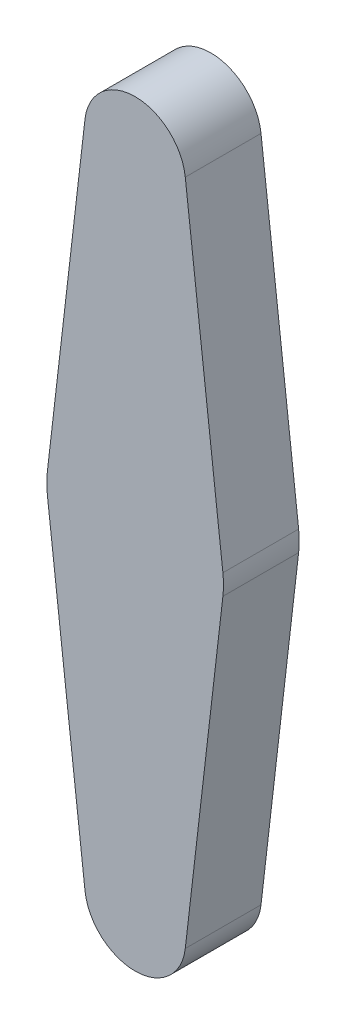
ISO-10303-21;
HEADER;
FILE_DESCRIPTION(('STEP AP214'),'2;1');
FILE_NAME('part.step','',(''),(''),'','','');
FILE_SCHEMA(('AUTOMOTIVE_DESIGN { 1 0 10303 214 1 1 1 1 }'));
ENDSEC;
DATA;
#1=APPLICATION_CONTEXT('core data for automotive mechanical design processes');
#2=APPLICATION_PROTOCOL_DEFINITION('international standard','automotive_design',2000,#1);
#3=PRODUCT_CONTEXT('',#1,'mechanical');
#4=PRODUCT('Part','Part','',(#3));
#5=PRODUCT_RELATED_PRODUCT_CATEGORY('part','',(#4));
#6=PRODUCT_DEFINITION_FORMATION('','',#4);
#7=PRODUCT_DEFINITION_CONTEXT('part definition',#1,'design');
#8=PRODUCT_DEFINITION('design','',#6,#7);
#9=PRODUCT_DEFINITION_SHAPE('','',#8);
#10=(LENGTH_UNIT() NAMED_UNIT(*) SI_UNIT(.MILLI.,.METRE.));
#11=(NAMED_UNIT(*) PLANE_ANGLE_UNIT() SI_UNIT($,.RADIAN.));
#12=(NAMED_UNIT(*) SI_UNIT($,.STERADIAN.) SOLID_ANGLE_UNIT());
#13=UNCERTAINTY_MEASURE_WITH_UNIT(LENGTH_MEASURE(1.E-05),#10,'distance_accuracy_value','');
#14=(GEOMETRIC_REPRESENTATION_CONTEXT(3) GLOBAL_UNCERTAINTY_ASSIGNED_CONTEXT((#13)) GLOBAL_UNIT_ASSIGNED_CONTEXT((#10,
#11,#12)) REPRESENTATION_CONTEXT('',''));
#15=CARTESIAN_POINT('',(0.,0.,0.));
#16=DIRECTION('',(0.,0.,1.));
#17=DIRECTION('',(1.,0.,0.));
#18=AXIS2_PLACEMENT_3D('',#15,#16,#17);
#19=CARTESIAN_POINT('',(0.,-13.,3.));
#20=DIRECTION('',(0.,0.,-1.));
#21=DIRECTION('',(-1.,0.,0.));
#22=AXIS2_PLACEMENT_3D('',#19,#20,#21);
#23=CYLINDRICAL_SURFACE('',#22,2.);
#24=CARTESIAN_POINT('',(0.,-13.,0.));
#25=DIRECTION('',(0.,0.,1.));
#26=DIRECTION('',(-1.,0.,0.));
#27=AXIS2_PLACEMENT_3D('',#24,#25,#26);
#28=CIRCLE('',#27,2.);
#29=CARTESIAN_POINT('',(-1.9866417800223,-13.2307692307692,0.));
#30=VERTEX_POINT('',#29);
#31=CARTESIAN_POINT('',(1.9866417800223,-13.2307692307692,0.));
#32=VERTEX_POINT('',#31);
#33=EDGE_CURVE('E135',#30,#32,#28,.T.);
#34=ORIENTED_EDGE('',*,*,#33,.T.);
#35=DIRECTION('',(0.,0.,-1.));
#36=VECTOR('',#35,1.);
#37=CARTESIAN_POINT('',(1.9866417800223,-13.2307692307692,3.));
#38=LINE('',#37,#36);
#39=CARTESIAN_POINT('',(1.9866417800223,-13.2307692307692,3.));
#40=VERTEX_POINT('',#39);
#41=EDGE_CURVE('E11',#40,#32,#38,.T.);
#42=ORIENTED_EDGE('',*,*,#41,.F.);
#43=CARTESIAN_POINT('',(0.,-13.,3.));
#44=DIRECTION('',(0.,0.,1.));
#45=DIRECTION('',(-1.,0.,0.));
#46=AXIS2_PLACEMENT_3D('',#43,#44,#45);
#47=CIRCLE('',#46,2.);
#48=CARTESIAN_POINT('',(-1.9866417800223,-13.2307692307692,3.));
#49=VERTEX_POINT('',#48);
#50=EDGE_CURVE('E149',#49,#40,#47,.T.);
#51=ORIENTED_EDGE('',*,*,#50,.F.);
#52=DIRECTION('',(0.,0.,-1.));
#53=VECTOR('',#52,1.);
#54=CARTESIAN_POINT('',(-1.9866417800223,-13.2307692307692,3.));
#55=LINE('',#54,#53);
#56=EDGE_CURVE('E131',#49,#30,#55,.T.);
#57=ORIENTED_EDGE('',*,*,#56,.T.);
#58=EDGE_LOOP('',(#34,#42,#51,#57));
#59=FACE_BOUND('',#58,.T.);
#60=ADVANCED_FACE('F39',(#59),#23,.T.);
#61=CARTESIAN_POINT('',(1.9866417800223,-13.2307692307692,3.));
#62=DIRECTION('',(-0.99332089001115,0.115384615384615,0.));
#63=DIRECTION('',(-0.115384615384615,-0.993320890011151,0.));
#64=AXIS2_PLACEMENT_3D('',#61,#62,#63);
#65=PLANE('',#64);
#66=DIRECTION('',(0.115384615384615,0.993320890011151,0.));
#67=VECTOR('',#66,1.);
#68=CARTESIAN_POINT('',(1.9866417800223,-13.2307692307692,0.));
#69=LINE('',#68,#67);
#70=CARTESIAN_POINT('',(3.47662311503903,-0.403846153846155,0.));
#71=VERTEX_POINT('',#70);
#72=EDGE_CURVE('E138',#32,#71,#69,.T.);
#73=ORIENTED_EDGE('',*,*,#72,.T.);
#74=DIRECTION('',(0.,0.,-1.));
#75=VECTOR('',#74,1.);
#76=CARTESIAN_POINT('',(3.47662311503903,-0.403846153846155,3.));
#77=LINE('',#76,#75);
#78=CARTESIAN_POINT('',(3.47662311503903,-0.403846153846155,3.));
#79=VERTEX_POINT('',#78);
#80=EDGE_CURVE('E47',#79,#71,#77,.T.);
#81=ORIENTED_EDGE('',*,*,#80,.F.);
#82=DIRECTION('',(0.115384615384615,0.993320890011151,0.));
#83=VECTOR('',#82,1.);
#84=CARTESIAN_POINT('',(1.9866417800223,-13.2307692307692,3.));
#85=LINE('',#84,#83);
#86=EDGE_CURVE('E98',#40,#79,#85,.T.);
#87=ORIENTED_EDGE('',*,*,#86,.F.);
#88=ORIENTED_EDGE('',*,*,#41,.T.);
#89=EDGE_LOOP('',(#73,#81,#87,#88));
#90=FACE_BOUND('',#89,.T.);
#91=ADVANCED_FACE('F184',(#90),#65,.F.);
#92=CARTESIAN_POINT('',(0.,0.,3.));
#93=DIRECTION('',(0.,0.,-1.));
#94=DIRECTION('',(-1.,0.,0.));
#95=AXIS2_PLACEMENT_3D('',#92,#93,#94);
#96=CYLINDRICAL_SURFACE('',#95,3.5);
#97=CARTESIAN_POINT('',(0.,0.,0.));
#98=DIRECTION('',(0.,0.,1.));
#99=DIRECTION('',(1.,0.,0.));
#100=AXIS2_PLACEMENT_3D('',#97,#98,#99);
#101=CIRCLE('',#100,3.5);
#102=CARTESIAN_POINT('',(3.47662311503903,0.403846153846154,0.));
#103=VERTEX_POINT('',#102);
#104=EDGE_CURVE('E140',#71,#103,#101,.T.);
#105=ORIENTED_EDGE('',*,*,#104,.T.);
#106=DIRECTION('',(0.,0.,-1.));
#107=VECTOR('',#106,1.);
#108=CARTESIAN_POINT('',(3.47662311503903,0.403846153846154,3.));
#109=LINE('',#108,#107);
#110=CARTESIAN_POINT('',(3.47662311503903,0.403846153846154,3.));
#111=VERTEX_POINT('',#110);
#112=EDGE_CURVE('E156',#111,#103,#109,.T.);
#113=ORIENTED_EDGE('',*,*,#112,.F.);
#114=CARTESIAN_POINT('',(0.,0.,3.));
#115=DIRECTION('',(0.,0.,1.));
#116=DIRECTION('',(1.,0.,0.));
#117=AXIS2_PLACEMENT_3D('',#114,#115,#116);
#118=CIRCLE('',#117,3.5);
#119=EDGE_CURVE('E164',#79,#111,#118,.T.);
#120=ORIENTED_EDGE('',*,*,#119,.F.);
#121=ORIENTED_EDGE('',*,*,#80,.T.);
#122=EDGE_LOOP('',(#105,#113,#120,#121));
#123=FACE_BOUND('',#122,.T.);
#124=ADVANCED_FACE('F162',(#123),#96,.T.);
#125=CARTESIAN_POINT('',(1.9866417800223,13.2307692307692,3.));
#126=DIRECTION('',(-0.99332089001115,-0.115384615384615,0.));
#127=DIRECTION('',(0.115384615384615,-0.993320890011151,0.));
#128=AXIS2_PLACEMENT_3D('',#125,#126,#127);
#129=PLANE('',#128);
#130=DIRECTION('',(-0.115384615384615,0.993320890011151,0.));
#131=VECTOR('',#130,1.);
#132=CARTESIAN_POINT('',(1.9866417800223,13.2307692307692,0.));
#133=LINE('',#132,#131);
#134=CARTESIAN_POINT('',(1.9866417800223,13.2307692307692,0.));
#135=VERTEX_POINT('',#134);
#136=EDGE_CURVE('E142',#103,#135,#133,.T.);
#137=ORIENTED_EDGE('',*,*,#136,.T.);
#138=DIRECTION('',(0.,0.,-1.));
#139=VECTOR('',#138,1.);
#140=CARTESIAN_POINT('',(1.9866417800223,13.2307692307692,3.));
#141=LINE('',#140,#139);
#142=CARTESIAN_POINT('',(1.9866417800223,13.2307692307692,3.));
#143=VERTEX_POINT('',#142);
#144=EDGE_CURVE('E153',#143,#135,#141,.T.);
#145=ORIENTED_EDGE('',*,*,#144,.F.);
#146=DIRECTION('',(-0.115384615384615,0.993320890011151,0.));
#147=VECTOR('',#146,1.);
#148=CARTESIAN_POINT('',(1.9866417800223,13.2307692307692,3.));
#149=LINE('',#148,#147);
#150=EDGE_CURVE('E176',#111,#143,#149,.T.);
#151=ORIENTED_EDGE('',*,*,#150,.F.);
#152=ORIENTED_EDGE('',*,*,#112,.T.);
#153=EDGE_LOOP('',(#137,#145,#151,#152));
#154=FACE_BOUND('',#153,.T.);
#155=ADVANCED_FACE('F172',(#154),#129,.F.);
#156=CARTESIAN_POINT('',(0.,13.,3.));
#157=DIRECTION('',(0.,0.,-1.));
#158=DIRECTION('',(-1.,0.,0.));
#159=AXIS2_PLACEMENT_3D('',#156,#157,#158);
#160=CYLINDRICAL_SURFACE('',#159,2.);
#161=CARTESIAN_POINT('',(0.,13.,0.));
#162=DIRECTION('',(0.,0.,1.));
#163=DIRECTION('',(1.,0.,0.));
#164=AXIS2_PLACEMENT_3D('',#161,#162,#163);
#165=CIRCLE('',#164,2.);
#166=CARTESIAN_POINT('',(-1.9866417800223,13.2307692307692,0.));
#167=VERTEX_POINT('',#166);
#168=EDGE_CURVE('E144',#135,#167,#165,.T.);
#169=ORIENTED_EDGE('',*,*,#168,.T.);
#170=DIRECTION('',(0.,0.,-1.));
#171=VECTOR('',#170,1.);
#172=CARTESIAN_POINT('',(-1.9866417800223,13.2307692307692,3.));
#173=LINE('',#172,#171);
#174=CARTESIAN_POINT('',(-1.9866417800223,13.2307692307692,3.));
#175=VERTEX_POINT('',#174);
#176=EDGE_CURVE('E126',#175,#167,#173,.T.);
#177=ORIENTED_EDGE('',*,*,#176,.F.);
#178=CARTESIAN_POINT('',(0.,13.,3.));
#179=DIRECTION('',(0.,0.,1.));
#180=DIRECTION('',(1.,0.,0.));
#181=AXIS2_PLACEMENT_3D('',#178,#179,#180);
#182=CIRCLE('',#181,2.);
#183=EDGE_CURVE('E117',#143,#175,#182,.T.);
#184=ORIENTED_EDGE('',*,*,#183,.F.);
#185=ORIENTED_EDGE('',*,*,#144,.T.);
#186=EDGE_LOOP('',(#169,#177,#184,#185));
#187=FACE_BOUND('',#186,.T.);
#188=ADVANCED_FACE('F175',(#187),#160,.T.);
#189=CARTESIAN_POINT('',(-1.9866417800223,13.2307692307692,3.));
#190=DIRECTION('',(0.993320890011151,-0.115384615384615,0.));
#191=DIRECTION('',(0.115384615384615,0.993320890011151,0.));
#192=AXIS2_PLACEMENT_3D('',#189,#190,#191);
#193=PLANE('',#192);
#194=DIRECTION('',(-0.115384615384615,-0.993320890011151,0.));
#195=VECTOR('',#194,1.);
#196=CARTESIAN_POINT('',(-1.9866417800223,13.2307692307692,0.));
#197=LINE('',#196,#195);
#198=CARTESIAN_POINT('',(-3.47662311503903,0.403846153846153,0.));
#199=VERTEX_POINT('',#198);
#200=EDGE_CURVE('E125',#167,#199,#197,.T.);
#201=ORIENTED_EDGE('',*,*,#200,.T.);
#202=DIRECTION('',(0.,0.,-1.));
#203=VECTOR('',#202,1.);
#204=CARTESIAN_POINT('',(-3.47662311503903,0.403846153846153,3.));
#205=LINE('',#204,#203);
#206=CARTESIAN_POINT('',(-3.47662311503903,0.403846153846153,3.));
#207=VERTEX_POINT('',#206);
#208=EDGE_CURVE('E122',#207,#199,#205,.T.);
#209=ORIENTED_EDGE('',*,*,#208,.F.);
#210=DIRECTION('',(-0.115384615384615,-0.993320890011151,0.));
#211=VECTOR('',#210,1.);
#212=CARTESIAN_POINT('',(-1.9866417800223,13.2307692307692,3.));
#213=LINE('',#212,#211);
#214=EDGE_CURVE('E111',#175,#207,#213,.T.);
#215=ORIENTED_EDGE('',*,*,#214,.F.);
#216=ORIENTED_EDGE('',*,*,#176,.T.);
#217=EDGE_LOOP('',(#201,#209,#215,#216));
#218=FACE_BOUND('',#217,.T.);
#219=ADVANCED_FACE('F123',(#218),#193,.F.);
#220=CARTESIAN_POINT('',(0.,0.,3.));
#221=DIRECTION('',(0.,0.,-1.));
#222=DIRECTION('',(-1.,0.,0.));
#223=AXIS2_PLACEMENT_3D('',#220,#221,#222);
#224=CYLINDRICAL_SURFACE('',#223,3.5);
#225=CARTESIAN_POINT('',(0.,0.,0.));
#226=DIRECTION('',(0.,0.,1.));
#227=DIRECTION('',(1.,0.,0.));
#228=AXIS2_PLACEMENT_3D('',#225,#226,#227);
#229=CIRCLE('',#228,3.5);
#230=CARTESIAN_POINT('',(-3.47662311503903,-0.403846153846154,0.));
#231=VERTEX_POINT('',#230);
#232=EDGE_CURVE('E84',#199,#231,#229,.T.);
#233=ORIENTED_EDGE('',*,*,#232,.T.);
#234=DIRECTION('',(0.,0.,-1.));
#235=VECTOR('',#234,1.);
#236=CARTESIAN_POINT('',(-3.47662311503903,-0.403846153846154,3.));
#237=LINE('',#236,#235);
#238=CARTESIAN_POINT('',(-3.47662311503903,-0.403846153846154,3.));
#239=VERTEX_POINT('',#238);
#240=EDGE_CURVE('E127',#239,#231,#237,.T.);
#241=ORIENTED_EDGE('',*,*,#240,.F.);
#242=CARTESIAN_POINT('',(0.,0.,3.));
#243=DIRECTION('',(0.,0.,1.));
#244=DIRECTION('',(1.,0.,0.));
#245=AXIS2_PLACEMENT_3D('',#242,#243,#244);
#246=CIRCLE('',#245,3.5);
#247=EDGE_CURVE('E115',#207,#239,#246,.T.);
#248=ORIENTED_EDGE('',*,*,#247,.F.);
#249=ORIENTED_EDGE('',*,*,#208,.T.);
#250=EDGE_LOOP('',(#233,#241,#248,#249));
#251=FACE_BOUND('',#250,.T.);
#252=ADVANCED_FACE('F129',(#251),#224,.T.);
#253=CARTESIAN_POINT('',(-1.9866417800223,-13.2307692307692,3.));
#254=DIRECTION('',(0.993320890011151,0.115384615384615,0.));
#255=DIRECTION('',(-0.115384615384615,0.993320890011151,0.));
#256=AXIS2_PLACEMENT_3D('',#253,#254,#255);
#257=PLANE('',#256);
#258=DIRECTION('',(0.115384615384615,-0.993320890011151,0.));
#259=VECTOR('',#258,1.);
#260=CARTESIAN_POINT('',(-1.9866417800223,-13.2307692307692,0.));
#261=LINE('',#260,#259);
#262=EDGE_CURVE('E90',#231,#30,#261,.T.);
#263=ORIENTED_EDGE('',*,*,#262,.T.);
#264=ORIENTED_EDGE('',*,*,#56,.F.);
#265=DIRECTION('',(0.115384615384615,-0.993320890011151,0.));
#266=VECTOR('',#265,1.);
#267=CARTESIAN_POINT('',(-1.9866417800223,-13.2307692307692,3.));
#268=LINE('',#267,#266);
#269=EDGE_CURVE('E55',#239,#49,#268,.T.);
#270=ORIENTED_EDGE('',*,*,#269,.F.);
#271=ORIENTED_EDGE('',*,*,#240,.T.);
#272=EDGE_LOOP('',(#263,#264,#270,#271));
#273=FACE_BOUND('',#272,.T.);
#274=ADVANCED_FACE('F200',(#273),#257,.F.);
#275=CARTESIAN_POINT('',(0.,-13.,3.));
#276=DIRECTION('',(0.,0.,-1.));
#277=DIRECTION('',(-1.,0.,0.));
#278=AXIS2_PLACEMENT_3D('',#275,#276,#277);
#279=PLANE('',#278);
#280=ORIENTED_EDGE('',*,*,#50,.T.);
#281=ORIENTED_EDGE('',*,*,#86,.T.);
#282=ORIENTED_EDGE('',*,*,#119,.T.);
#283=ORIENTED_EDGE('',*,*,#150,.T.);
#284=ORIENTED_EDGE('',*,*,#183,.T.);
#285=ORIENTED_EDGE('',*,*,#214,.T.);
#286=ORIENTED_EDGE('',*,*,#247,.T.);
#287=ORIENTED_EDGE('',*,*,#269,.T.);
#288=EDGE_LOOP('',(#280,#281,#282,#283,#284,#285,#286,#287));
#289=FACE_BOUND('',#288,.T.);
#290=ADVANCED_FACE('F113',(#289),#279,.F.);
#291=CARTESIAN_POINT('',(0.,-13.,0.));
#292=DIRECTION('',(0.,0.,-1.));
#293=DIRECTION('',(-1.,0.,0.));
#294=AXIS2_PLACEMENT_3D('',#291,#292,#293);
#295=PLANE('',#294);
#296=ORIENTED_EDGE('',*,*,#33,.F.);
#297=ORIENTED_EDGE('',*,*,#262,.F.);
#298=ORIENTED_EDGE('',*,*,#232,.F.);
#299=ORIENTED_EDGE('',*,*,#200,.F.);
#300=ORIENTED_EDGE('',*,*,#168,.F.);
#301=ORIENTED_EDGE('',*,*,#136,.F.);
#302=ORIENTED_EDGE('',*,*,#104,.F.);
#303=ORIENTED_EDGE('',*,*,#72,.F.);
#304=EDGE_LOOP('',(#296,#297,#298,#299,#300,#301,#302,#303));
#305=FACE_BOUND('',#304,.T.);
#306=ADVANCED_FACE('F168',(#305),#295,.T.);
#307=CLOSED_SHELL('',(#60,#91,#124,#155,#188,#219,#252,#274,#290,#306));
#308=MANIFOLD_SOLID_BREP('B2',#307);
#309=ADVANCED_BREP_SHAPE_REPRESENTATION('',(#18,#308),#14);
#310=SHAPE_DEFINITION_REPRESENTATION(#9,#309);
ENDSEC;
END-ISO-10303-21;
